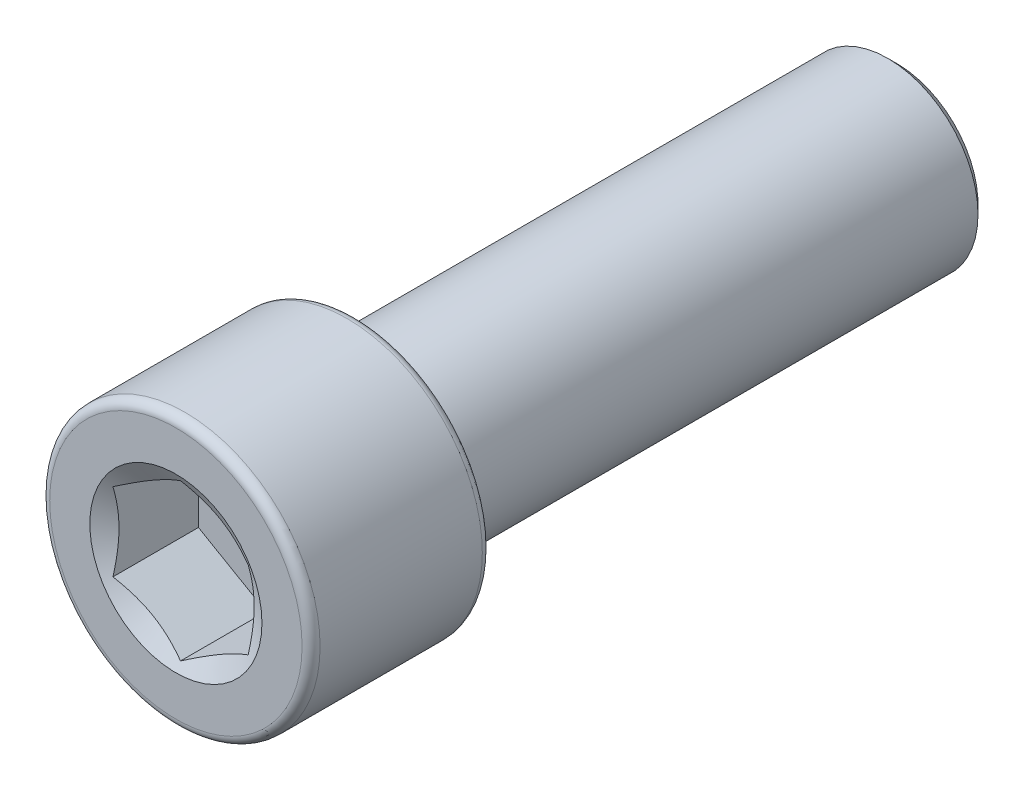
ISO-10303-21;
HEADER;
FILE_DESCRIPTION(('STEP AP214'),'2;1');
FILE_NAME('part.step','',(''),(''),'','','');
FILE_SCHEMA(('AUTOMOTIVE_DESIGN { 1 0 10303 214 1 1 1 1 }'));
ENDSEC;
DATA;
#1=APPLICATION_CONTEXT('core data for automotive mechanical design processes');
#2=APPLICATION_PROTOCOL_DEFINITION('international standard','automotive_design',2000,#1);
#3=PRODUCT_CONTEXT('',#1,'mechanical');
#4=PRODUCT('Part','Part','',(#3));
#5=PRODUCT_RELATED_PRODUCT_CATEGORY('part','',(#4));
#6=PRODUCT_DEFINITION_FORMATION('','',#4);
#7=PRODUCT_DEFINITION_CONTEXT('part definition',#1,'design');
#8=PRODUCT_DEFINITION('design','',#6,#7);
#9=PRODUCT_DEFINITION_SHAPE('','',#8);
#10=(LENGTH_UNIT() NAMED_UNIT(*) SI_UNIT(.MILLI.,.METRE.));
#11=(NAMED_UNIT(*) PLANE_ANGLE_UNIT() SI_UNIT($,.RADIAN.));
#12=(NAMED_UNIT(*) SI_UNIT($,.STERADIAN.) SOLID_ANGLE_UNIT());
#13=UNCERTAINTY_MEASURE_WITH_UNIT(LENGTH_MEASURE(1.E-05),#10,'distance_accuracy_value','');
#14=(GEOMETRIC_REPRESENTATION_CONTEXT(3) GLOBAL_UNCERTAINTY_ASSIGNED_CONTEXT((#13)) GLOBAL_UNIT_ASSIGNED_CONTEXT((#10,
#11,#12)) REPRESENTATION_CONTEXT('',''));
#15=CARTESIAN_POINT('',(0.,0.,0.));
#16=DIRECTION('',(0.,0.,1.));
#17=DIRECTION('',(1.,0.,0.));
#18=AXIS2_PLACEMENT_3D('',#15,#16,#17);
#19=CARTESIAN_POINT('',(0.,0.,-12.7));
#20=DIRECTION('',(0.,0.,-1.));
#21=DIRECTION('',(-1.,0.,0.));
#22=AXIS2_PLACEMENT_3D('',#19,#20,#21);
#23=PLANE('',#22);
#24=CARTESIAN_POINT('',(0.,0.,-12.7));
#25=DIRECTION('',(0.,0.,-1.));
#26=DIRECTION('',(-1.,0.,0.));
#27=AXIS2_PLACEMENT_3D('',#24,#25,#26);
#28=CIRCLE('',#27,2.8575);
#29=CARTESIAN_POINT('',(-2.8575,0.,-12.7));
#30=VERTEX_POINT('',#29);
#31=EDGE_CURVE('E52',#30,#30,#28,.T.);
#32=ORIENTED_EDGE('',*,*,#31,.T.);
#33=EDGE_LOOP('',(#32));
#34=FACE_BOUND('',#33,.T.);
#35=ADVANCED_FACE('F39',(#34),#23,.T.);
#36=CARTESIAN_POINT('',(0.,0.,-12.7));
#37=DIRECTION('',(0.,0.,1.));
#38=DIRECTION('',(1.,0.,0.));
#39=AXIS2_PLACEMENT_3D('',#36,#37,#38);
#40=CONICAL_SURFACE('',#39,2.8575,0.785398163397451);
#41=CARTESIAN_POINT('',(0.,0.,-12.3825));
#42=DIRECTION('',(0.,0.,-1.));
#43=DIRECTION('',(-1.,0.,0.));
#44=AXIS2_PLACEMENT_3D('',#41,#42,#43);
#45=CIRCLE('',#44,3.17500000000001);
#46=CARTESIAN_POINT('',(-3.17500000000001,0.,-12.3825));
#47=VERTEX_POINT('',#46);
#48=EDGE_CURVE('E137',#47,#47,#45,.T.);
#49=ORIENTED_EDGE('',*,*,#48,.T.);
#50=EDGE_LOOP('',(#49));
#51=FACE_BOUND('',#50,.T.);
#52=ORIENTED_EDGE('',*,*,#31,.F.);
#53=EDGE_LOOP('',(#52));
#54=FACE_BOUND('',#53,.T.);
#55=ADVANCED_FACE('F143',(#51,#54),#40,.T.);
#56=CARTESIAN_POINT('',(0.,0.,-12.7));
#57=DIRECTION('',(0.,0.,-1.));
#58=DIRECTION('',(-1.,0.,0.));
#59=AXIS2_PLACEMENT_3D('',#56,#57,#58);
#60=CYLINDRICAL_SURFACE('',#59,3.17500000000001);
#61=CARTESIAN_POINT('',(0.,0.,6.35000000000001));
#62=DIRECTION('',(0.,0.,-1.));
#63=DIRECTION('',(-1.,0.,0.));
#64=AXIS2_PLACEMENT_3D('',#61,#62,#63);
#65=CIRCLE('',#64,3.175);
#66=CARTESIAN_POINT('',(-3.175,0.,6.35000000000001));
#67=VERTEX_POINT('',#66);
#68=EDGE_CURVE('E134',#67,#67,#65,.T.);
#69=ORIENTED_EDGE('',*,*,#68,.T.);
#70=EDGE_LOOP('',(#69));
#71=FACE_BOUND('',#70,.T.);
#72=ORIENTED_EDGE('',*,*,#48,.F.);
#73=EDGE_LOOP('',(#72));
#74=FACE_BOUND('',#73,.T.);
#75=ADVANCED_FACE('F145',(#71,#74),#60,.T.);
#76=CARTESIAN_POINT('',(0.,3.175,6.35000000000001));
#77=DIRECTION('',(0.,0.,-1.));
#78=DIRECTION('',(-1.,0.,0.));
#79=AXIS2_PLACEMENT_3D('',#76,#77,#78);
#80=PLANE('',#79);
#81=CARTESIAN_POINT('',(0.,0.,6.35000000000001));
#82=DIRECTION('',(0.,0.,-1.));
#83=DIRECTION('',(-1.,0.,0.));
#84=AXIS2_PLACEMENT_3D('',#81,#82,#83);
#85=CIRCLE('',#84,4.445);
#86=CARTESIAN_POINT('',(-4.445,0.,6.35000000000001));
#87=VERTEX_POINT('',#86);
#88=EDGE_CURVE('E131',#87,#87,#85,.T.);
#89=ORIENTED_EDGE('',*,*,#88,.T.);
#90=EDGE_LOOP('',(#89));
#91=FACE_BOUND('',#90,.T.);
#92=ORIENTED_EDGE('',*,*,#68,.F.);
#93=EDGE_LOOP('',(#92));
#94=FACE_BOUND('',#93,.T.);
#95=ADVANCED_FACE('F151',(#91,#94),#80,.T.);
#96=CARTESIAN_POINT('',(0.,0.,6.66750000000001));
#97=DIRECTION('',(0.,0.,-1.));
#98=DIRECTION('',(-1.,0.,0.));
#99=AXIS2_PLACEMENT_3D('',#96,#97,#98);
#100=TOROIDAL_SURFACE('',#99,4.445,0.3175);
#101=CARTESIAN_POINT('',(0.,0.,6.66750000000001));
#102=DIRECTION('',(0.,0.,-1.));
#103=DIRECTION('',(-1.,0.,0.));
#104=AXIS2_PLACEMENT_3D('',#101,#102,#103);
#105=CIRCLE('',#104,4.7625);
#106=CARTESIAN_POINT('',(-4.7625,0.,6.66750000000001));
#107=VERTEX_POINT('',#106);
#108=EDGE_CURVE('E128',#107,#107,#105,.T.);
#109=ORIENTED_EDGE('',*,*,#108,.T.);
#110=EDGE_LOOP('',(#109));
#111=FACE_BOUND('',#110,.T.);
#112=ORIENTED_EDGE('',*,*,#88,.F.);
#113=EDGE_LOOP('',(#112));
#114=FACE_BOUND('',#113,.T.);
#115=ADVANCED_FACE('F157',(#111,#114),#100,.T.);
#116=CARTESIAN_POINT('',(0.,0.,-12.7));
#117=DIRECTION('',(0.,0.,-1.));
#118=DIRECTION('',(-1.,0.,0.));
#119=AXIS2_PLACEMENT_3D('',#116,#117,#118);
#120=CYLINDRICAL_SURFACE('',#119,4.7625);
#121=CARTESIAN_POINT('',(0.,0.,12.3825));
#122=DIRECTION('',(0.,0.,-1.));
#123=DIRECTION('',(-1.,0.,0.));
#124=AXIS2_PLACEMENT_3D('',#121,#122,#123);
#125=CIRCLE('',#124,4.7625);
#126=CARTESIAN_POINT('',(-4.7625,0.,12.3825));
#127=VERTEX_POINT('',#126);
#128=EDGE_CURVE('E125',#127,#127,#125,.T.);
#129=ORIENTED_EDGE('',*,*,#128,.T.);
#130=EDGE_LOOP('',(#129));
#131=FACE_BOUND('',#130,.T.);
#132=ORIENTED_EDGE('',*,*,#108,.F.);
#133=EDGE_LOOP('',(#132));
#134=FACE_BOUND('',#133,.T.);
#135=ADVANCED_FACE('F161',(#131,#134),#120,.T.);
#136=CARTESIAN_POINT('',(0.,0.,12.3825));
#137=DIRECTION('',(0.,0.,-1.));
#138=DIRECTION('',(-1.,0.,0.));
#139=AXIS2_PLACEMENT_3D('',#136,#137,#138);
#140=TOROIDAL_SURFACE('',#139,4.445,0.3175);
#141=CARTESIAN_POINT('',(0.,0.,12.7));
#142=DIRECTION('',(0.,0.,-1.));
#143=DIRECTION('',(-1.,0.,0.));
#144=AXIS2_PLACEMENT_3D('',#141,#142,#143);
#145=CIRCLE('',#144,4.445);
#146=CARTESIAN_POINT('',(-4.445,0.,12.7));
#147=VERTEX_POINT('',#146);
#148=EDGE_CURVE('E122',#147,#147,#145,.T.);
#149=ORIENTED_EDGE('',*,*,#148,.T.);
#150=EDGE_LOOP('',(#149));
#151=FACE_BOUND('',#150,.T.);
#152=ORIENTED_EDGE('',*,*,#128,.F.);
#153=EDGE_LOOP('',(#152));
#154=FACE_BOUND('',#153,.T.);
#155=ADVANCED_FACE('F165',(#151,#154),#140,.T.);
#156=CARTESIAN_POINT('',(0.,4.44499999999999,12.7));
#157=DIRECTION('',(0.,0.,1.));
#158=DIRECTION('',(1.,0.,0.));
#159=AXIS2_PLACEMENT_3D('',#156,#157,#158);
#160=PLANE('',#159);
#161=CARTESIAN_POINT('',(0.,0.,12.7));
#162=DIRECTION('',(0.,0.,1.));
#163=DIRECTION('',(1.,0.,0.));
#164=AXIS2_PLACEMENT_3D('',#161,#162,#163);
#165=CIRCLE('',#164,3.03219221417966);
#166=CARTESIAN_POINT('',(3.03219221417966,0.,12.7));
#167=VERTEX_POINT('',#166);
#168=EDGE_CURVE('E259',#167,#167,#165,.T.);
#169=ORIENTED_EDGE('',*,*,#168,.F.);
#170=EDGE_LOOP('',(#169));
#171=FACE_BOUND('',#170,.T.);
#172=ORIENTED_EDGE('',*,*,#148,.F.);
#173=EDGE_LOOP('',(#172));
#174=FACE_BOUND('',#173,.T.);
#175=ADVANCED_FACE('F169',(#171,#174),#160,.T.);
#176=CARTESIAN_POINT('',(0.,0.,12.7));
#177=DIRECTION('',(0.,0.,1.));
#178=DIRECTION('',(1.,0.,0.));
#179=AXIS2_PLACEMENT_3D('',#176,#177,#178);
#180=CONICAL_SURFACE('',#179,3.03219221417966,1.0471975511966);
#181=ORIENTED_EDGE('',*,*,#168,.T.);
#182=EDGE_LOOP('',(#181));
#183=FACE_BOUND('',#182,.T.);
#184=CARTESIAN_POINT('',(2.38145,1.37469985845396,12.5369296797747));
#185=CARTESIAN_POINT('',(2.27680510857802,1.43511661468575,12.5020335875339));
#186=CARTESIAN_POINT('',(2.1712569313955,1.49605488319456,12.4702965816836));
#187=CARTESIAN_POINT('',(1.95833280582789,1.61898668440798,12.4148986717318));
#188=CARTESIAN_POINT('',(1.85095307338658,1.68098240183848,12.3912573664923));
#189=CARTESIAN_POINT('',(1.63752441306378,1.80420549632863,12.3544553443056));
#190=CARTESIAN_POINT('',(1.53150832846243,1.86541391131165,12.3410497054727));
#191=CARTESIAN_POINT('',(1.31897718209788,1.9881188258764,12.3250446234132));
#192=CARTESIAN_POINT('',(1.21246289310218,2.04961487930061,12.3224319282234));
#193=CARTESIAN_POINT('',(1.01342600969027,2.16452887751714,12.3278600893658));
#194=CARTESIAN_POINT('',(0.920873657438137,2.21796400300405,12.3345681458576));
#195=CARTESIAN_POINT('',(0.736371946153154,2.32448611568038,12.3558309696216));
#196=CARTESIAN_POINT('',(0.644423225529254,2.37757273428423,12.3703930040322));
#197=CARTESIAN_POINT('',(0.459540942889937,2.48431456993443,12.4067978377253));
#198=CARTESIAN_POINT('',(0.366630787034622,2.53795627342795,12.4287949938814));
#199=CARTESIAN_POINT('',(0.182196405744562,2.64443951311358,12.4787202236105));
#200=CARTESIAN_POINT('',(0.0906698164537948,2.69728241407862,12.5066365624169));
#201=CARTESIAN_POINT('',(-0.000199999999999644,2.74974612706943,12.5369296797747));
#202=B_SPLINE_CURVE_WITH_KNOTS('',3,(#184,#185,#186,#187,#188,#189,#190,#191,#192,#193,#194,
#195,#196,#197,#198,#199,#200,#201),.UNSPECIFIED.,.F.,.F.,(4,2,2,2,2,2,2,2,4),(0.,
0.377463001720441,0.755833447356087,1.1248388545394,1.49339104874266,1.81432726847353,
2.1355609551887,2.4639212191382,2.79163649648301),.UNSPECIFIED.);
#203=CARTESIAN_POINT('',(2.38125,1.3748153285078,12.5368630089087));
#204=VERTEX_POINT('',#203);
#205=CARTESIAN_POINT('',(0.,2.74963065701559,12.5368630089087));
#206=VERTEX_POINT('',#205);
#207=EDGE_CURVE('E106',#204,#206,#202,.T.);
#208=ORIENTED_EDGE('',*,*,#207,.F.);
#209=CARTESIAN_POINT('',(2.38125,-3.59976633824538,13.4412611644295));
#210=CARTESIAN_POINT('',(2.38125,-3.49646395881337,13.3915324836855));
#211=CARTESIAN_POINT('',(2.38125,-3.39291407009265,13.3423085892494));
#212=CARTESIAN_POINT('',(2.38125,-3.18518717181846,13.2451564977165));
#213=CARTESIAN_POINT('',(2.38125,-3.08101005703532,13.1972285258866));
#214=CARTESIAN_POINT('',(2.38125,-2.87131401421193,13.1026930902144));
#215=CARTESIAN_POINT('',(2.38125,-2.76579079437246,13.0560951113206));
#216=CARTESIAN_POINT('',(2.38125,-2.55387118203947,12.9649364827971));
#217=CARTESIAN_POINT('',(2.38125,-2.44747483422772,12.9203757296712));
#218=CARTESIAN_POINT('',(2.38125,-2.2306719684591,12.832631851781));
#219=CARTESIAN_POINT('',(2.38125,-2.12023600195454,12.7895210708127));
#220=CARTESIAN_POINT('',(2.38125,-1.89803839134693,12.7067937390092));
#221=CARTESIAN_POINT('',(2.38125,-1.78627659559217,12.6671775923576));
#222=CARTESIAN_POINT('',(2.38125,-1.56149041735539,12.5925477895721));
#223=CARTESIAN_POINT('',(2.38125,-1.44846944761671,12.5575239630361));
#224=CARTESIAN_POINT('',(2.38125,-1.22081073511454,12.4932629117452));
#225=CARTESIAN_POINT('',(2.38125,-1.10617354309387,12.4640237645329));
#226=CARTESIAN_POINT('',(2.38125,-0.875790756878795,12.4129337388859));
#227=CARTESIAN_POINT('',(2.38125,-0.760052762621305,12.3910492449066));
#228=CARTESIAN_POINT('',(2.38125,-0.527241538813738,12.3559822843521));
#229=CARTESIAN_POINT('',(2.38125,-0.410168413785967,12.3427991412743));
#230=CARTESIAN_POINT('',(2.38125,-0.176757909156527,12.3263592365983));
#231=CARTESIAN_POINT('',(2.38125,-0.0604292020566071,12.3229823294229));
#232=CARTESIAN_POINT('',(2.38125,0.172102526495441,12.3261301571011));
#233=CARTESIAN_POINT('',(2.38125,0.288305540624635,12.3326554407246));
#234=CARTESIAN_POINT('',(2.38125,0.488407104907266,12.3519728989663));
#235=CARTESIAN_POINT('',(2.38125,0.572526768128162,12.3625877365416));
#236=CARTESIAN_POINT('',(2.38125,0.740085928751665,12.3882929254538));
#237=CARTESIAN_POINT('',(2.38125,0.823525319662306,12.4033839641938));
#238=CARTESIAN_POINT('',(2.38125,1.07273325586548,12.45457343129));
#239=CARTESIAN_POINT('',(2.38125,1.23729002677747,12.4965771837148));
#240=CARTESIAN_POINT('',(2.38125,1.56668315583936,12.5929511253518));
#241=CARTESIAN_POINT('',(2.38125,1.73144052822361,12.6475811694067));
#242=CARTESIAN_POINT('',(2.38125,1.9763129223075,12.7356187750601));
#243=CARTESIAN_POINT('',(2.38125,2.05754928439703,12.7659756920629));
#244=CARTESIAN_POINT('',(2.38125,2.2193629714156,12.8283957224258));
#245=CARTESIAN_POINT('',(2.38125,2.29994030817707,12.8604588050747));
#246=CARTESIAN_POINT('',(2.38125,2.50911202812042,12.9458324530248));
#247=CARTESIAN_POINT('',(2.38125,2.63725060996073,13.00025731756));
#248=CARTESIAN_POINT('',(2.38125,2.89233256605395,13.1118480388214));
#249=CARTESIAN_POINT('',(2.38125,3.01927584315841,13.1690141160782));
#250=CARTESIAN_POINT('',(2.38125,3.27222855247941,13.2854567661809));
#251=CARTESIAN_POINT('',(2.38125,3.39823772867165,13.3447338935472));
#252=CARTESIAN_POINT('',(2.38125,3.64947609912468,13.4649213116136));
#253=CARTESIAN_POINT('',(2.38125,3.7747052747107,13.5258316412321));
#254=CARTESIAN_POINT('',(2.38125,4.14976436460614,13.7106293734581));
#255=CARTESIAN_POINT('',(2.38125,4.39864815512717,13.8364349728279));
#256=CARTESIAN_POINT('',(2.38125,4.8946762561178,14.0913121050035));
#257=CARTESIAN_POINT('',(2.38125,5.14182083564058,14.2203831177985));
#258=CARTESIAN_POINT('',(2.38125,5.61084172457361,14.468066970761));
#259=CARTESIAN_POINT('',(2.38125,5.83282885020021,14.5864703062649));
#260=CARTESIAN_POINT('',(2.38125,6.27608857926107,14.8246296719868));
#261=CARTESIAN_POINT('',(2.38125,6.4973611487004,14.9443857653776));
#262=CARTESIAN_POINT('',(2.38125,6.93875603869061,15.1845822776973));
#263=CARTESIAN_POINT('',(2.38125,7.15887985119658,15.3050199580106));
#264=CARTESIAN_POINT('',(2.38125,7.59868091402186,15.546675883145));
#265=CARTESIAN_POINT('',(2.38125,7.81835819130606,15.6678940788725));
#266=CARTESIAN_POINT('',(2.38125,8.03787642276091,15.7893977522439));
#267=B_SPLINE_CURVE_WITH_KNOTS('',3,(#209,#210,#211,#212,#213,#214,#215,#216,#217,#218,#219,
#220,#221,#222,#223,#224,#225,#226,#227,#228,#229,#230,#231,#232,#233,#234,#235,#236,#237,#238,
#239,#240,#241,#242,#243,#244,#245,#246,#247,#248,#249,#250,#251,#252,#253,#254,#255,#256,#257,
#258,#259,#260,#261,#262,#263,#264,#265,#266),.UNSPECIFIED.,.F.,.F.,(4,2,2,2,2,2,2,2,2,2,2,2,2,
2,2,2,2,2,2,2,2,2,2,2,2,2,2,2,4),(0.,0.343950780921492,0.687960970461109,1.0340054839437,
1.38003239789182,1.73564357991988,2.09129583755096,2.44614664320017,2.80087932031082,
3.15396785782399,3.50702894058495,3.85574569670582,4.20448177908076,4.45871798756719,
4.71299325893001,5.22184880640701,5.74229337432347,6.00244751925216,6.26259698295642,
6.68020411231574,7.09784489471861,7.51559620207542,7.93335747307525,8.76993188334098,
9.60637389902895,10.3611381643167,11.1159378234818,11.8686893766334,12.6213940361872),.UNSPECIFIED.);
#268=CARTESIAN_POINT('',(2.38125,-1.37481532850779,12.5368630089087));
#269=VERTEX_POINT('',#268);
#270=EDGE_CURVE('E215',#269,#204,#267,.T.);
#271=ORIENTED_EDGE('',*,*,#270,.F.);
#272=CARTESIAN_POINT('',(-0.000200000000000967,-2.74974612706943,12.5369296797747));
#273=CARTESIAN_POINT('',(0.104444891421975,-2.68932937083763,12.5020335875339));
#274=CARTESIAN_POINT('',(0.209993068604495,-2.62839110232883,12.4702965816836));
#275=CARTESIAN_POINT('',(0.42291719417211,-2.5054593011154,12.4148986717318));
#276=CARTESIAN_POINT('',(0.530296926613418,-2.4434635836849,12.3912573664923));
#277=CARTESIAN_POINT('',(0.743725586936213,-2.32024048919475,12.3544553443056));
#278=CARTESIAN_POINT('',(0.849741671537566,-2.25903207421173,12.3410497054727));
#279=CARTESIAN_POINT('',(1.06227281790212,-2.13632715964698,12.3250446234132));
#280=CARTESIAN_POINT('',(1.16878710689781,-2.07483110622277,12.3224319282234));
#281=CARTESIAN_POINT('',(1.36782399030972,-1.95991710800624,12.3278600893658));
#282=CARTESIAN_POINT('',(1.46037634256186,-1.90648198251934,12.3345681458576));
#283=CARTESIAN_POINT('',(1.64487805384684,-1.79995986984301,12.3558309696216));
#284=CARTESIAN_POINT('',(1.73682677447074,-1.74687325123916,12.3703930040322));
#285=CARTESIAN_POINT('',(1.92170905711006,-1.64013141558895,12.4067978377253));
#286=CARTESIAN_POINT('',(2.01461921296538,-1.58648971209544,12.4287949938814));
#287=CARTESIAN_POINT('',(2.19905359425544,-1.4800064724098,12.4787202236105));
#288=CARTESIAN_POINT('',(2.2905801835462,-1.42716357144477,12.5066365624169));
#289=CARTESIAN_POINT('',(2.38145,-1.37469985845396,12.5369296797747));
#290=B_SPLINE_CURVE_WITH_KNOTS('',3,(#272,#273,#274,#275,#276,#277,#278,#279,#280,#281,#282,
#283,#284,#285,#286,#287,#288,#289),.UNSPECIFIED.,.F.,.F.,(4,2,2,2,2,2,2,2,4),(0.,
0.377463001720441,0.755833447356087,1.1248388545394,1.49339104874266,1.81432726847354,
2.1355609551887,2.4639212191382,2.79163649648301),.UNSPECIFIED.);
#291=CARTESIAN_POINT('',(0.,-2.74963065701559,12.5368630089087));
#292=VERTEX_POINT('',#291);
#293=EDGE_CURVE('E209',#292,#269,#290,.T.);
#294=ORIENTED_EDGE('',*,*,#293,.F.);
#295=CARTESIAN_POINT('',(-2.38145,-1.37469985845396,12.5369296797747));
#296=CARTESIAN_POINT('',(-2.27680510857802,-1.43511661468575,12.5020335875339));
#297=CARTESIAN_POINT('',(-2.1712569313955,-1.49605488319456,12.4702965816836));
#298=CARTESIAN_POINT('',(-1.95833280582789,-1.61898668440799,12.4148986717318));
#299=CARTESIAN_POINT('',(-1.85095307338658,-1.68098240183848,12.3912573664923));
#300=CARTESIAN_POINT('',(-1.63752441306378,-1.80420549632863,12.3544553443056));
#301=CARTESIAN_POINT('',(-1.53150832846243,-1.86541391131165,12.3410497054727));
#302=CARTESIAN_POINT('',(-1.31897718209788,-1.98811882587641,12.3250446234132));
#303=CARTESIAN_POINT('',(-1.21246289310218,-2.04961487930061,12.3224319282234));
#304=CARTESIAN_POINT('',(-1.01342600969027,-2.16452887751714,12.3278600893658));
#305=CARTESIAN_POINT('',(-0.920873657438135,-2.21796400300405,12.3345681458576));
#306=CARTESIAN_POINT('',(-0.736371946153153,-2.32448611568038,12.3558309696216));
#307=CARTESIAN_POINT('',(-0.644423225529253,-2.37757273428423,12.3703930040322));
#308=CARTESIAN_POINT('',(-0.459540942889937,-2.48431456993443,12.4067978377253));
#309=CARTESIAN_POINT('',(-0.366630787034622,-2.53795627342795,12.4287949938814));
#310=CARTESIAN_POINT('',(-0.182196405744562,-2.64443951311358,12.4787202236105));
#311=CARTESIAN_POINT('',(-0.0906698164537953,-2.69728241407862,12.5066365624169));
#312=CARTESIAN_POINT('',(0.000199999999998825,-2.74974612706943,12.5369296797747));
#313=B_SPLINE_CURVE_WITH_KNOTS('',3,(#295,#296,#297,#298,#299,#300,#301,#302,#303,#304,#305,
#306,#307,#308,#309,#310,#311,#312),.UNSPECIFIED.,.F.,.F.,(4,2,2,2,2,2,2,2,4),(0.,
0.377463001720441,0.755833447356087,1.1248388545394,1.49339104874266,1.81432726847353,
2.1355609551887,2.4639212191382,2.791636496483),.UNSPECIFIED.);
#314=CARTESIAN_POINT('',(-2.38125,-1.3748153285078,12.5368630089087));
#315=VERTEX_POINT('',#314);
#316=EDGE_CURVE('E59',#315,#292,#313,.T.);
#317=ORIENTED_EDGE('',*,*,#316,.F.);
#318=CARTESIAN_POINT('',(-2.38125,-3.59976633824538,13.4412611644295));
#319=CARTESIAN_POINT('',(-2.38125,-3.49646395881337,13.3915324836855));
#320=CARTESIAN_POINT('',(-2.38125,-3.39291407009265,13.3423085892494));
#321=CARTESIAN_POINT('',(-2.38125,-3.18518717181846,13.2451564977165));
#322=CARTESIAN_POINT('',(-2.38125,-3.08101005703532,13.1972285258866));
#323=CARTESIAN_POINT('',(-2.38125,-2.87131401421193,13.1026930902144));
#324=CARTESIAN_POINT('',(-2.38125,-2.76579079437246,13.0560951113206));
#325=CARTESIAN_POINT('',(-2.38125,-2.55387118203947,12.9649364827971));
#326=CARTESIAN_POINT('',(-2.38125,-2.44747483422772,12.9203757296712));
#327=CARTESIAN_POINT('',(-2.38125,-2.2306719684591,12.832631851781));
#328=CARTESIAN_POINT('',(-2.38125,-2.12023600195455,12.7895210708127));
#329=CARTESIAN_POINT('',(-2.38125,-1.89803839134693,12.7067937390092));
#330=CARTESIAN_POINT('',(-2.38125,-1.78627659559217,12.6671775923576));
#331=CARTESIAN_POINT('',(-2.38125,-1.56149041735539,12.5925477895721));
#332=CARTESIAN_POINT('',(-2.38125,-1.44846944761671,12.5575239630361));
#333=CARTESIAN_POINT('',(-2.38125,-1.22081073511455,12.4932629117452));
#334=CARTESIAN_POINT('',(-2.38125,-1.10617354309388,12.4640237645329));
#335=CARTESIAN_POINT('',(-2.38125,-0.875790756878798,12.4129337388859));
#336=CARTESIAN_POINT('',(-2.38125,-0.760052762621308,12.3910492449066));
#337=CARTESIAN_POINT('',(-2.38125,-0.527241538813741,12.3559822843521));
#338=CARTESIAN_POINT('',(-2.38125,-0.41016841378597,12.3427991412743));
#339=CARTESIAN_POINT('',(-2.38125,-0.176757909156529,12.3263592365983));
#340=CARTESIAN_POINT('',(-2.38125,-0.0604292020566098,12.3229823294229));
#341=CARTESIAN_POINT('',(-2.38125,0.172102526495439,12.3261301571011));
#342=CARTESIAN_POINT('',(-2.38125,0.288305540624632,12.3326554407246));
#343=CARTESIAN_POINT('',(-2.38125,0.488407104907264,12.3519728989663));
#344=CARTESIAN_POINT('',(-2.38125,0.57252676812816,12.3625877365416));
#345=CARTESIAN_POINT('',(-2.38125,0.740085928751663,12.3882929254538));
#346=CARTESIAN_POINT('',(-2.38125,0.823525319662304,12.4033839641938));
#347=CARTESIAN_POINT('',(-2.38125,1.07273325586548,12.45457343129));
#348=CARTESIAN_POINT('',(-2.38125,1.23729002677747,12.4965771837148));
#349=CARTESIAN_POINT('',(-2.38125,1.56668315583936,12.5929511253518));
#350=CARTESIAN_POINT('',(-2.38125,1.7314405282236,12.6475811694067));
#351=CARTESIAN_POINT('',(-2.38125,1.97631292230749,12.7356187750601));
#352=CARTESIAN_POINT('',(-2.38125,2.05754928439703,12.7659756920629));
#353=CARTESIAN_POINT('',(-2.38125,2.2193629714156,12.8283957224258));
#354=CARTESIAN_POINT('',(-2.38125,2.29994030817707,12.8604588050747));
#355=CARTESIAN_POINT('',(-2.38125,2.50911202812041,12.9458324530248));
#356=CARTESIAN_POINT('',(-2.38125,2.63725060996073,13.00025731756));
#357=CARTESIAN_POINT('',(-2.38125,2.89233256605394,13.1118480388214));
#358=CARTESIAN_POINT('',(-2.38125,3.01927584315841,13.1690141160782));
#359=CARTESIAN_POINT('',(-2.38125,3.27222855247941,13.2854567661809));
#360=CARTESIAN_POINT('',(-2.38125,3.39823772867165,13.3447338935472));
#361=CARTESIAN_POINT('',(-2.38125,3.64947609912467,13.4649213116136));
#362=CARTESIAN_POINT('',(-2.38125,3.77470527471069,13.5258316412321));
#363=CARTESIAN_POINT('',(-2.38125,4.14976436460614,13.7106293734581));
#364=CARTESIAN_POINT('',(-2.38125,4.39864815512716,13.8364349728279));
#365=CARTESIAN_POINT('',(-2.38125,4.8946762561178,14.0913121050035));
#366=CARTESIAN_POINT('',(-2.38125,5.14182083564057,14.2203831177985));
#367=CARTESIAN_POINT('',(-2.38125,5.61084172457361,14.468066970761));
#368=CARTESIAN_POINT('',(-2.38125,5.83282885020021,14.5864703062649));
#369=CARTESIAN_POINT('',(-2.38125,6.27608857926107,14.8246296719868));
#370=CARTESIAN_POINT('',(-2.38125,6.4973611487004,14.9443857653776));
#371=CARTESIAN_POINT('',(-2.38125,6.93875603869061,15.1845822776973));
#372=CARTESIAN_POINT('',(-2.38125,7.15887985119658,15.3050199580106));
#373=CARTESIAN_POINT('',(-2.38125,7.59868091402186,15.546675883145));
#374=CARTESIAN_POINT('',(-2.38125,7.81835819130606,15.6678940788725));
#375=CARTESIAN_POINT('',(-2.38125,8.03787642276091,15.7893977522439));
#376=B_SPLINE_CURVE_WITH_KNOTS('',3,(#318,#319,#320,#321,#322,#323,#324,#325,#326,#327,#328,
#329,#330,#331,#332,#333,#334,#335,#336,#337,#338,#339,#340,#341,#342,#343,#344,#345,#346,#347,
#348,#349,#350,#351,#352,#353,#354,#355,#356,#357,#358,#359,#360,#361,#362,#363,#364,#365,#366,
#367,#368,#369,#370,#371,#372,#373,#374,#375),.UNSPECIFIED.,.F.,.F.,(4,2,2,2,2,2,2,2,2,2,2,2,2,
2,2,2,2,2,2,2,2,2,2,2,2,2,2,2,4),(0.,0.343950780921493,0.687960970461109,1.0340054839437,
1.38003239789182,1.73564357991988,2.09129583755096,2.44614664320017,2.80087932031082,
3.15396785782399,3.50702894058495,3.85574569670582,4.20448177908075,4.45871798756719,
4.71299325893001,5.22184880640701,5.74229337432346,6.00244751925216,6.26259698295642,
6.68020411231574,7.09784489471861,7.51559620207541,7.93335747307524,8.76993188334097,
9.60637389902895,10.3611381643167,11.1159378234818,11.8686893766334,12.6213940361872),.UNSPECIFIED.);
#377=CARTESIAN_POINT('',(-2.38125,1.37481532850779,12.5368630089087));
#378=VERTEX_POINT('',#377);
#379=EDGE_CURVE('E11',#378,#315,#376,.F.);
#380=ORIENTED_EDGE('',*,*,#379,.F.);
#381=CARTESIAN_POINT('',(0.000200000000000588,2.74974612706943,12.5369296797747));
#382=CARTESIAN_POINT('',(-0.104444891421975,2.68932937083763,12.5020335875339));
#383=CARTESIAN_POINT('',(-0.209993068604495,2.62839110232883,12.4702965816836));
#384=CARTESIAN_POINT('',(-0.42291719417211,2.5054593011154,12.4148986717318));
#385=CARTESIAN_POINT('',(-0.530296926613418,2.4434635836849,12.3912573664923));
#386=CARTESIAN_POINT('',(-0.743725586936213,2.32024048919475,12.3544553443056));
#387=CARTESIAN_POINT('',(-0.849741671537566,2.25903207421173,12.3410497054727));
#388=CARTESIAN_POINT('',(-1.06227281790212,2.13632715964698,12.3250446234132));
#389=CARTESIAN_POINT('',(-1.16878710689781,2.07483110622277,12.3224319282234));
#390=CARTESIAN_POINT('',(-1.36782399030972,1.95991710800624,12.3278600893658));
#391=CARTESIAN_POINT('',(-1.46037634256186,1.90648198251934,12.3345681458576));
#392=CARTESIAN_POINT('',(-1.64487805384684,1.79995986984301,12.3558309696216));
#393=CARTESIAN_POINT('',(-1.73682677447074,1.74687325123916,12.3703930040322));
#394=CARTESIAN_POINT('',(-1.92170905711006,1.64013141558895,12.4067978377253));
#395=CARTESIAN_POINT('',(-2.01461921296537,1.58648971209544,12.4287949938814));
#396=CARTESIAN_POINT('',(-2.19905359425543,1.4800064724098,12.4787202236105));
#397=CARTESIAN_POINT('',(-2.2905801835462,1.42716357144477,12.5066365624169));
#398=CARTESIAN_POINT('',(-2.38145,1.37469985845396,12.5369296797747));
#399=B_SPLINE_CURVE_WITH_KNOTS('',3,(#381,#382,#383,#384,#385,#386,#387,#388,#389,#390,#391,
#392,#393,#394,#395,#396,#397,#398),.UNSPECIFIED.,.F.,.F.,(4,2,2,2,2,2,2,2,4),(0.,
0.377463001720441,0.755833447356087,1.1248388545394,1.49339104874266,1.81432726847353,
2.1355609551887,2.4639212191382,2.79163649648301),.UNSPECIFIED.);
#400=EDGE_CURVE('E97',#206,#378,#399,.T.);
#401=ORIENTED_EDGE('',*,*,#400,.F.);
#402=EDGE_LOOP('',(#208,#271,#294,#317,#380,#401));
#403=FACE_BOUND('',#402,.T.);
#404=ADVANCED_FACE('F96',(#183,#403),#180,.F.);
#405=CARTESIAN_POINT('',(0.,0.,9.525));
#406=DIRECTION('',(0.,0.,1.));
#407=DIRECTION('',(1.,0.,0.));
#408=AXIS2_PLACEMENT_3D('',#405,#406,#407);
#409=PLANE('',#408);
#410=DIRECTION('',(-0.866025403784438,-0.5,0.));
#411=VECTOR('',#410,1.);
#412=CARTESIAN_POINT('',(0.,2.74963065701559,9.525));
#413=LINE('',#412,#411);
#414=CARTESIAN_POINT('',(0.,2.74963065701559,9.525));
#415=VERTEX_POINT('',#414);
#416=CARTESIAN_POINT('',(-2.38125,1.37481532850779,9.525));
#417=VERTEX_POINT('',#416);
#418=EDGE_CURVE('E105',#415,#417,#413,.T.);
#419=ORIENTED_EDGE('',*,*,#418,.T.);
#420=DIRECTION('',(0.,-1.,0.));
#421=VECTOR('',#420,1.);
#422=CARTESIAN_POINT('',(-2.38125,1.37481532850779,9.525));
#423=LINE('',#422,#421);
#424=CARTESIAN_POINT('',(-2.38125,-1.3748153285078,9.525));
#425=VERTEX_POINT('',#424);
#426=EDGE_CURVE('E110',#417,#425,#423,.T.);
#427=ORIENTED_EDGE('',*,*,#426,.T.);
#428=DIRECTION('',(0.866025403784439,-0.5,0.));
#429=VECTOR('',#428,1.);
#430=CARTESIAN_POINT('',(-2.38125,-1.3748153285078,9.525));
#431=LINE('',#430,#429);
#432=CARTESIAN_POINT('',(0.,-2.74963065701559,9.525));
#433=VERTEX_POINT('',#432);
#434=EDGE_CURVE('E241',#425,#433,#431,.T.);
#435=ORIENTED_EDGE('',*,*,#434,.T.);
#436=DIRECTION('',(0.866025403784439,0.5,0.));
#437=VECTOR('',#436,1.);
#438=CARTESIAN_POINT('',(0.,-2.74963065701559,9.525));
#439=LINE('',#438,#437);
#440=CARTESIAN_POINT('',(2.38125,-1.37481532850779,9.525));
#441=VERTEX_POINT('',#440);
#442=EDGE_CURVE('E245',#433,#441,#439,.T.);
#443=ORIENTED_EDGE('',*,*,#442,.T.);
#444=DIRECTION('',(0.,1.,0.));
#445=VECTOR('',#444,1.);
#446=CARTESIAN_POINT('',(2.38125,-1.37481532850779,9.525));
#447=LINE('',#446,#445);
#448=CARTESIAN_POINT('',(2.38125,1.3748153285078,9.525));
#449=VERTEX_POINT('',#448);
#450=EDGE_CURVE('E118',#441,#449,#447,.T.);
#451=ORIENTED_EDGE('',*,*,#450,.T.);
#452=DIRECTION('',(-0.866025403784439,0.5,0.));
#453=VECTOR('',#452,1.);
#454=CARTESIAN_POINT('',(2.38125,1.3748153285078,9.525));
#455=LINE('',#454,#453);
#456=EDGE_CURVE('E113',#449,#415,#455,.T.);
#457=ORIENTED_EDGE('',*,*,#456,.T.);
#458=EDGE_LOOP('',(#419,#427,#435,#443,#451,#457));
#459=FACE_BOUND('',#458,.T.);
#460=ADVANCED_FACE('F195',(#459),#409,.T.);
#461=CARTESIAN_POINT('',(-2.38125,1.37481532850779,9.525));
#462=DIRECTION('',(-1.,0.,0.));
#463=DIRECTION('',(0.,-1.,0.));
#464=AXIS2_PLACEMENT_3D('',#461,#462,#463);
#465=PLANE('',#464);
#466=DIRECTION('',(0.,0.,1.));
#467=VECTOR('',#466,1.);
#468=CARTESIAN_POINT('',(-2.38125,1.37481532850779,9.525));
#469=LINE('',#468,#467);
#470=EDGE_CURVE('E103',#417,#378,#469,.T.);
#471=ORIENTED_EDGE('',*,*,#470,.T.);
#472=ORIENTED_EDGE('',*,*,#379,.T.);
#473=DIRECTION('',(0.,0.,1.));
#474=VECTOR('',#473,1.);
#475=CARTESIAN_POINT('',(-2.38125,-1.3748153285078,9.525));
#476=LINE('',#475,#474);
#477=EDGE_CURVE('E112',#425,#315,#476,.T.);
#478=ORIENTED_EDGE('',*,*,#477,.F.);
#479=ORIENTED_EDGE('',*,*,#426,.F.);
#480=EDGE_LOOP('',(#471,#472,#478,#479));
#481=FACE_BOUND('',#480,.T.);
#482=ADVANCED_FACE('F108',(#481),#465,.F.);
#483=CARTESIAN_POINT('',(-2.38125,-1.3748153285078,9.525));
#484=DIRECTION('',(-0.5,-0.866025403784439,0.));
#485=DIRECTION('',(0.866025403784439,-0.5,0.));
#486=AXIS2_PLACEMENT_3D('',#483,#484,#485);
#487=PLANE('',#486);
#488=ORIENTED_EDGE('',*,*,#477,.T.);
#489=ORIENTED_EDGE('',*,*,#316,.T.);
#490=DIRECTION('',(0.,0.,1.));
#491=VECTOR('',#490,1.);
#492=CARTESIAN_POINT('',(0.,-2.74963065701559,9.525));
#493=LINE('',#492,#491);
#494=EDGE_CURVE('E115',#433,#292,#493,.T.);
#495=ORIENTED_EDGE('',*,*,#494,.F.);
#496=ORIENTED_EDGE('',*,*,#434,.F.);
#497=EDGE_LOOP('',(#488,#489,#495,#496));
#498=FACE_BOUND('',#497,.T.);
#499=ADVANCED_FACE('F230',(#498),#487,.F.);
#500=CARTESIAN_POINT('',(0.,-2.74963065701559,9.525));
#501=DIRECTION('',(0.5,-0.866025403784439,0.));
#502=DIRECTION('',(0.866025403784439,0.5,0.));
#503=AXIS2_PLACEMENT_3D('',#500,#501,#502);
#504=PLANE('',#503);
#505=ORIENTED_EDGE('',*,*,#494,.T.);
#506=ORIENTED_EDGE('',*,*,#293,.T.);
#507=DIRECTION('',(0.,0.,1.));
#508=VECTOR('',#507,1.);
#509=CARTESIAN_POINT('',(2.38125,-1.37481532850779,9.525));
#510=LINE('',#509,#508);
#511=EDGE_CURVE('E255',#441,#269,#510,.T.);
#512=ORIENTED_EDGE('',*,*,#511,.F.);
#513=ORIENTED_EDGE('',*,*,#442,.F.);
#514=EDGE_LOOP('',(#505,#506,#512,#513));
#515=FACE_BOUND('',#514,.T.);
#516=ADVANCED_FACE('F225',(#515),#504,.F.);
#517=CARTESIAN_POINT('',(2.38125,-1.37481532850779,9.525));
#518=DIRECTION('',(1.,0.,0.));
#519=DIRECTION('',(0.,1.,0.));
#520=AXIS2_PLACEMENT_3D('',#517,#518,#519);
#521=PLANE('',#520);
#522=ORIENTED_EDGE('',*,*,#511,.T.);
#523=ORIENTED_EDGE('',*,*,#270,.T.);
#524=DIRECTION('',(0.,0.,1.));
#525=VECTOR('',#524,1.);
#526=CARTESIAN_POINT('',(2.38125,1.3748153285078,9.525));
#527=LINE('',#526,#525);
#528=EDGE_CURVE('E252',#449,#204,#527,.T.);
#529=ORIENTED_EDGE('',*,*,#528,.F.);
#530=ORIENTED_EDGE('',*,*,#450,.F.);
#531=EDGE_LOOP('',(#522,#523,#529,#530));
#532=FACE_BOUND('',#531,.T.);
#533=ADVANCED_FACE('F222',(#532),#521,.F.);
#534=CARTESIAN_POINT('',(2.38125,1.3748153285078,9.525));
#535=DIRECTION('',(0.5,0.866025403784439,0.));
#536=DIRECTION('',(-0.866025403784439,0.5,0.));
#537=AXIS2_PLACEMENT_3D('',#534,#535,#536);
#538=PLANE('',#537);
#539=ORIENTED_EDGE('',*,*,#528,.T.);
#540=ORIENTED_EDGE('',*,*,#207,.T.);
#541=DIRECTION('',(0.,0.,1.));
#542=VECTOR('',#541,1.);
#543=CARTESIAN_POINT('',(0.,2.74963065701559,9.525));
#544=LINE('',#543,#542);
#545=EDGE_CURVE('E66',#415,#206,#544,.T.);
#546=ORIENTED_EDGE('',*,*,#545,.F.);
#547=ORIENTED_EDGE('',*,*,#456,.F.);
#548=EDGE_LOOP('',(#539,#540,#546,#547));
#549=FACE_BOUND('',#548,.T.);
#550=ADVANCED_FACE('F176',(#549),#538,.F.);
#551=CARTESIAN_POINT('',(0.,2.74963065701559,9.525));
#552=DIRECTION('',(-0.5,0.866025403784438,0.));
#553=DIRECTION('',(-0.866025403784439,-0.5,0.));
#554=AXIS2_PLACEMENT_3D('',#551,#552,#553);
#555=PLANE('',#554);
#556=ORIENTED_EDGE('',*,*,#545,.T.);
#557=ORIENTED_EDGE('',*,*,#400,.T.);
#558=ORIENTED_EDGE('',*,*,#470,.F.);
#559=ORIENTED_EDGE('',*,*,#418,.F.);
#560=EDGE_LOOP('',(#556,#557,#558,#559));
#561=FACE_BOUND('',#560,.T.);
#562=ADVANCED_FACE('F102',(#561),#555,.F.);
#563=CLOSED_SHELL('',(#35,#55,#75,#95,#115,#135,#155,#175,#404,#460,#482,#499,#516,#533,#550,#562));
#564=MANIFOLD_SOLID_BREP('B2',#563);
#565=ADVANCED_BREP_SHAPE_REPRESENTATION('',(#18,#564),#14);
#566=SHAPE_DEFINITION_REPRESENTATION(#9,#565);
ENDSEC;
END-ISO-10303-21;
